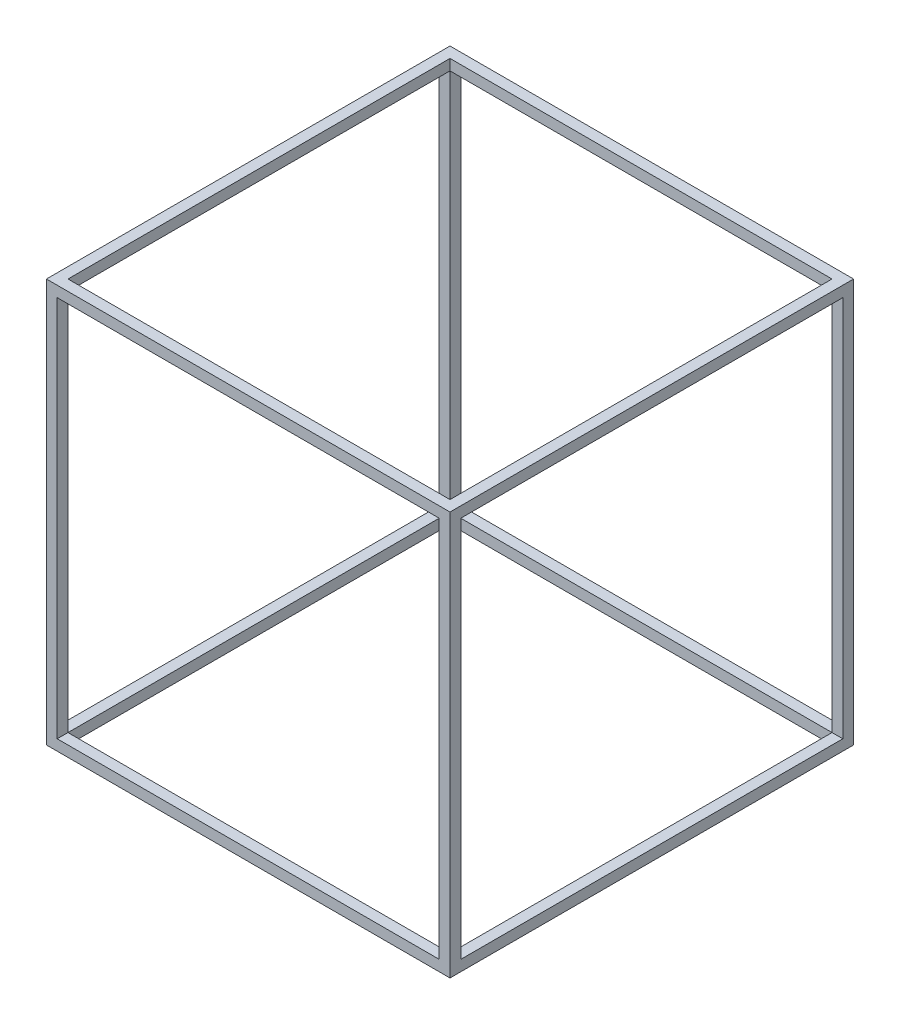
ISO-10303-21;
HEADER;
FILE_DESCRIPTION(('STEP AP214'),'2;1');
FILE_NAME('part.step','',(''),(''),'','','');
FILE_SCHEMA(('AUTOMOTIVE_DESIGN { 1 0 10303 214 1 1 1 1 }'));
ENDSEC;
DATA;
#1=APPLICATION_CONTEXT('core data for automotive mechanical design processes');
#2=APPLICATION_PROTOCOL_DEFINITION('international standard','automotive_design',2000,#1);
#3=PRODUCT_CONTEXT('',#1,'mechanical');
#4=PRODUCT('Part','Part','',(#3));
#5=PRODUCT_RELATED_PRODUCT_CATEGORY('part','',(#4));
#6=PRODUCT_DEFINITION_FORMATION('','',#4);
#7=PRODUCT_DEFINITION_CONTEXT('part definition',#1,'design');
#8=PRODUCT_DEFINITION('design','',#6,#7);
#9=PRODUCT_DEFINITION_SHAPE('','',#8);
#10=(LENGTH_UNIT() NAMED_UNIT(*) SI_UNIT(.MILLI.,.METRE.));
#11=(NAMED_UNIT(*) PLANE_ANGLE_UNIT() SI_UNIT($,.RADIAN.));
#12=(NAMED_UNIT(*) SI_UNIT($,.STERADIAN.) SOLID_ANGLE_UNIT());
#13=UNCERTAINTY_MEASURE_WITH_UNIT(LENGTH_MEASURE(1.E-05),#10,'distance_accuracy_value','');
#14=(GEOMETRIC_REPRESENTATION_CONTEXT(3) GLOBAL_UNCERTAINTY_ASSIGNED_CONTEXT((#13)) GLOBAL_UNIT_ASSIGNED_CONTEXT((#10,
#11,#12)) REPRESENTATION_CONTEXT('',''));
#15=CARTESIAN_POINT('',(0.,0.,0.));
#16=DIRECTION('',(0.,0.,1.));
#17=DIRECTION('',(1.,0.,0.));
#18=AXIS2_PLACEMENT_3D('',#15,#16,#17);
#19=CARTESIAN_POINT('',(0.,20.,0.));
#20=DIRECTION('',(0.,-1.,0.));
#21=DIRECTION('',(0.,0.,-1.));
#22=AXIS2_PLACEMENT_3D('',#19,#20,#21);
#23=PLANE('',#22);
#24=DIRECTION('',(-1.,0.,0.));
#25=VECTOR('',#24,1.);
#26=CARTESIAN_POINT('',(750.,20.,-20.));
#27=LINE('',#26,#25);
#28=CARTESIAN_POINT('',(750.,20.,-20.));
#29=VERTEX_POINT('',#28);
#30=CARTESIAN_POINT('',(730.,20.,-20.));
#31=VERTEX_POINT('',#30);
#32=EDGE_CURVE('E233',#29,#31,#27,.T.);
#33=ORIENTED_EDGE('',*,*,#32,.F.);
#34=DIRECTION('',(0.,0.,-1.));
#35=VECTOR('',#34,1.);
#36=CARTESIAN_POINT('',(750.,20.,0.));
#37=LINE('',#36,#35);
#38=CARTESIAN_POINT('',(750.,20.,-730.));
#39=VERTEX_POINT('',#38);
#40=EDGE_CURVE('E351',#29,#39,#37,.T.);
#41=ORIENTED_EDGE('',*,*,#40,.T.);
#42=DIRECTION('',(1.,0.,0.));
#43=VECTOR('',#42,1.);
#44=CARTESIAN_POINT('',(750.,20.,-730.));
#45=LINE('',#44,#43);
#46=CARTESIAN_POINT('',(730.,20.,-730.));
#47=VERTEX_POINT('',#46);
#48=EDGE_CURVE('E288',#47,#39,#45,.T.);
#49=ORIENTED_EDGE('',*,*,#48,.F.);
#50=DIRECTION('',(0.,0.,-1.));
#51=VECTOR('',#50,1.);
#52=CARTESIAN_POINT('',(730.,20.,-20.));
#53=LINE('',#52,#51);
#54=EDGE_CURVE('E474',#31,#47,#53,.T.);
#55=ORIENTED_EDGE('',*,*,#54,.F.);
#56=EDGE_LOOP('',(#33,#41,#49,#55));
#57=FACE_BOUND('',#56,.T.);
#58=ADVANCED_FACE('F33',(#57),#23,.F.);
#59=DIRECTION('',(0.,0.,1.));
#60=VECTOR('',#59,1.);
#61=CARTESIAN_POINT('',(730.,20.,0.));
#62=LINE('',#61,#60);
#63=CARTESIAN_POINT('',(730.,20.,0.));
#64=VERTEX_POINT('',#63);
#65=EDGE_CURVE('E248',#31,#64,#62,.T.);
#66=ORIENTED_EDGE('',*,*,#65,.F.);
#67=DIRECTION('',(1.,0.,0.));
#68=VECTOR('',#67,1.);
#69=CARTESIAN_POINT('',(20.,20.,-20.));
#70=LINE('',#69,#68);
#71=CARTESIAN_POINT('',(20.,20.,-20.));
#72=VERTEX_POINT('',#71);
#73=EDGE_CURVE('E444',#72,#31,#70,.T.);
#74=ORIENTED_EDGE('',*,*,#73,.F.);
#75=DIRECTION('',(0.,0.,-1.));
#76=VECTOR('',#75,1.);
#77=CARTESIAN_POINT('',(20.,20.,0.));
#78=LINE('',#77,#76);
#79=CARTESIAN_POINT('',(20.,20.,0.));
#80=VERTEX_POINT('',#79);
#81=EDGE_CURVE('E263',#80,#72,#78,.T.);
#82=ORIENTED_EDGE('',*,*,#81,.F.);
#83=DIRECTION('',(1.,0.,0.));
#84=VECTOR('',#83,1.);
#85=CARTESIAN_POINT('',(0.,20.,0.));
#86=LINE('',#85,#84);
#87=EDGE_CURVE('E51',#80,#64,#86,.T.);
#88=ORIENTED_EDGE('',*,*,#87,.T.);
#89=EDGE_LOOP('',(#66,#74,#82,#88));
#90=FACE_BOUND('',#89,.T.);
#91=ADVANCED_FACE('F397',(#90),#23,.F.);
#92=DIRECTION('',(-1.,0.,0.));
#93=VECTOR('',#92,1.);
#94=CARTESIAN_POINT('',(0.,20.,-20.));
#95=LINE('',#94,#93);
#96=CARTESIAN_POINT('',(0.,20.,-20.));
#97=VERTEX_POINT('',#96);
#98=EDGE_CURVE('E268',#72,#97,#95,.T.);
#99=ORIENTED_EDGE('',*,*,#98,.F.);
#100=DIRECTION('',(0.,0.,1.));
#101=VECTOR('',#100,1.);
#102=CARTESIAN_POINT('',(20.,20.,-20.));
#103=LINE('',#102,#101);
#104=CARTESIAN_POINT('',(20.,20.,-730.));
#105=VERTEX_POINT('',#104);
#106=EDGE_CURVE('E448',#105,#72,#103,.T.);
#107=ORIENTED_EDGE('',*,*,#106,.F.);
#108=DIRECTION('',(1.,0.,0.));
#109=VECTOR('',#108,1.);
#110=CARTESIAN_POINT('',(0.,20.,-730.));
#111=LINE('',#110,#109);
#112=CARTESIAN_POINT('',(0.,20.,-730.));
#113=VERTEX_POINT('',#112);
#114=EDGE_CURVE('E304',#113,#105,#111,.T.);
#115=ORIENTED_EDGE('',*,*,#114,.F.);
#116=DIRECTION('',(0.,0.,1.));
#117=VECTOR('',#116,1.);
#118=CARTESIAN_POINT('',(0.,20.,0.));
#119=LINE('',#118,#117);
#120=EDGE_CURVE('E59',#113,#97,#119,.T.);
#121=ORIENTED_EDGE('',*,*,#120,.T.);
#122=EDGE_LOOP('',(#99,#107,#115,#121));
#123=FACE_BOUND('',#122,.T.);
#124=ADVANCED_FACE('F404',(#123),#23,.F.);
#125=DIRECTION('',(0.,0.,1.));
#126=VECTOR('',#125,1.);
#127=CARTESIAN_POINT('',(730.,20.,-750.));
#128=LINE('',#127,#126);
#129=CARTESIAN_POINT('',(730.,20.,-750.));
#130=VERTEX_POINT('',#129);
#131=EDGE_CURVE('E283',#130,#47,#128,.T.);
#132=ORIENTED_EDGE('',*,*,#131,.F.);
#133=DIRECTION('',(-1.,0.,0.));
#134=VECTOR('',#133,1.);
#135=CARTESIAN_POINT('',(0.,20.,-750.));
#136=LINE('',#135,#134);
#137=CARTESIAN_POINT('',(20.,20.,-750.));
#138=VERTEX_POINT('',#137);
#139=EDGE_CURVE('E37',#130,#138,#136,.T.);
#140=ORIENTED_EDGE('',*,*,#139,.T.);
#141=DIRECTION('',(0.,0.,-1.));
#142=VECTOR('',#141,1.);
#143=CARTESIAN_POINT('',(20.,20.,-750.));
#144=LINE('',#143,#142);
#145=EDGE_CURVE('E309',#105,#138,#144,.T.);
#146=ORIENTED_EDGE('',*,*,#145,.F.);
#147=DIRECTION('',(-1.,0.,0.));
#148=VECTOR('',#147,1.);
#149=CARTESIAN_POINT('',(20.,20.,-730.));
#150=LINE('',#149,#148);
#151=EDGE_CURVE('E418',#47,#105,#150,.T.);
#152=ORIENTED_EDGE('',*,*,#151,.F.);
#153=EDGE_LOOP('',(#132,#140,#146,#152));
#154=FACE_BOUND('',#153,.T.);
#155=ADVANCED_FACE('F400',(#154),#23,.F.);
#156=CARTESIAN_POINT('',(0.,0.,0.));
#157=DIRECTION('',(0.,-1.,0.));
#158=DIRECTION('',(0.,0.,-1.));
#159=AXIS2_PLACEMENT_3D('',#156,#157,#158);
#160=PLANE('',#159);
#161=DIRECTION('',(0.,0.,1.));
#162=VECTOR('',#161,1.);
#163=CARTESIAN_POINT('',(0.,0.,0.));
#164=LINE('',#163,#162);
#165=CARTESIAN_POINT('',(0.,0.,-750.));
#166=VERTEX_POINT('',#165);
#167=CARTESIAN_POINT('',(0.,0.,0.));
#168=VERTEX_POINT('',#167);
#169=EDGE_CURVE('E354',#166,#168,#164,.T.);
#170=ORIENTED_EDGE('',*,*,#169,.F.);
#171=DIRECTION('',(-1.,0.,0.));
#172=VECTOR('',#171,1.);
#173=CARTESIAN_POINT('',(0.,0.,-750.));
#174=LINE('',#173,#172);
#175=CARTESIAN_POINT('',(750.,0.,-750.));
#176=VERTEX_POINT('',#175);
#177=EDGE_CURVE('E343',#176,#166,#174,.T.);
#178=ORIENTED_EDGE('',*,*,#177,.F.);
#179=DIRECTION('',(0.,0.,-1.));
#180=VECTOR('',#179,1.);
#181=CARTESIAN_POINT('',(750.,0.,0.));
#182=LINE('',#181,#180);
#183=CARTESIAN_POINT('',(750.,0.,0.));
#184=VERTEX_POINT('',#183);
#185=EDGE_CURVE('E359',#184,#176,#182,.T.);
#186=ORIENTED_EDGE('',*,*,#185,.F.);
#187=DIRECTION('',(1.,0.,0.));
#188=VECTOR('',#187,1.);
#189=CARTESIAN_POINT('',(0.,0.,0.));
#190=LINE('',#189,#188);
#191=EDGE_CURVE('E357',#168,#184,#190,.T.);
#192=ORIENTED_EDGE('',*,*,#191,.F.);
#193=EDGE_LOOP('',(#170,#178,#186,#192));
#194=FACE_BOUND('',#193,.T.);
#195=DIRECTION('',(-1.,0.,0.));
#196=VECTOR('',#195,1.);
#197=CARTESIAN_POINT('',(20.,0.,-730.));
#198=LINE('',#197,#196);
#199=CARTESIAN_POINT('',(730.,0.,-730.));
#200=VERTEX_POINT('',#199);
#201=CARTESIAN_POINT('',(20.,0.,-730.));
#202=VERTEX_POINT('',#201);
#203=EDGE_CURVE('E456',#200,#202,#198,.T.);
#204=ORIENTED_EDGE('',*,*,#203,.T.);
#205=DIRECTION('',(0.,0.,1.));
#206=VECTOR('',#205,1.);
#207=CARTESIAN_POINT('',(20.,0.,-20.));
#208=LINE('',#207,#206);
#209=CARTESIAN_POINT('',(20.,0.,-20.));
#210=VERTEX_POINT('',#209);
#211=EDGE_CURVE('E331',#202,#210,#208,.T.);
#212=ORIENTED_EDGE('',*,*,#211,.T.);
#213=DIRECTION('',(1.,0.,0.));
#214=VECTOR('',#213,1.);
#215=CARTESIAN_POINT('',(20.,0.,-20.));
#216=LINE('',#215,#214);
#217=CARTESIAN_POINT('',(730.,0.,-20.));
#218=VERTEX_POINT('',#217);
#219=EDGE_CURVE('E336',#210,#218,#216,.T.);
#220=ORIENTED_EDGE('',*,*,#219,.T.);
#221=DIRECTION('',(0.,0.,-1.));
#222=VECTOR('',#221,1.);
#223=CARTESIAN_POINT('',(730.,0.,-20.));
#224=LINE('',#223,#222);
#225=EDGE_CURVE('E469',#218,#200,#224,.T.);
#226=ORIENTED_EDGE('',*,*,#225,.T.);
#227=EDGE_LOOP('',(#204,#212,#220,#226));
#228=FACE_BOUND('',#227,.T.);
#229=ADVANCED_FACE('F378',(#194,#228),#160,.T.);
#230=CARTESIAN_POINT('',(0.,20.,0.));
#231=DIRECTION('',(1.,0.,0.));
#232=DIRECTION('',(0.,0.,-1.));
#233=AXIS2_PLACEMENT_3D('',#230,#231,#232);
#234=PLANE('',#233);
#235=DIRECTION('',(0.,-1.,0.));
#236=VECTOR('',#235,1.);
#237=CARTESIAN_POINT('',(0.,730.,-730.));
#238=LINE('',#237,#236);
#239=CARTESIAN_POINT('',(0.,730.,-730.));
#240=VERTEX_POINT('',#239);
#241=EDGE_CURVE('E327',#240,#113,#238,.T.);
#242=ORIENTED_EDGE('',*,*,#241,.F.);
#243=DIRECTION('',(0.,0.,1.));
#244=VECTOR('',#243,1.);
#245=CARTESIAN_POINT('',(0.,730.,-20.));
#246=LINE('',#245,#244);
#247=CARTESIAN_POINT('',(0.,730.,-20.));
#248=VERTEX_POINT('',#247);
#249=EDGE_CURVE('E236',#240,#248,#246,.T.);
#250=ORIENTED_EDGE('',*,*,#249,.T.);
#251=DIRECTION('',(0.,-1.,0.));
#252=VECTOR('',#251,1.);
#253=CARTESIAN_POINT('',(0.,730.,-20.));
#254=LINE('',#253,#252);
#255=EDGE_CURVE('E271',#248,#97,#254,.T.);
#256=ORIENTED_EDGE('',*,*,#255,.T.);
#257=ORIENTED_EDGE('',*,*,#120,.F.);
#258=EDGE_LOOP('',(#242,#250,#256,#257));
#259=FACE_BOUND('',#258,.T.);
#260=ORIENTED_EDGE('',*,*,#169,.T.);
#261=DIRECTION('',(0.,-1.,0.));
#262=VECTOR('',#261,1.);
#263=CARTESIAN_POINT('',(0.,20.,0.));
#264=LINE('',#263,#262);
#265=CARTESIAN_POINT('',(0.,750.,0.));
#266=VERTEX_POINT('',#265);
#267=EDGE_CURVE('E11',#266,#168,#264,.T.);
#268=ORIENTED_EDGE('',*,*,#267,.F.);
#269=DIRECTION('',(0.,0.,1.));
#270=VECTOR('',#269,1.);
#271=CARTESIAN_POINT('',(0.,750.,-750.));
#272=LINE('',#271,#270);
#273=CARTESIAN_POINT('',(0.,750.,-750.));
#274=VERTEX_POINT('',#273);
#275=EDGE_CURVE('E223',#274,#266,#272,.T.);
#276=ORIENTED_EDGE('',*,*,#275,.F.);
#277=DIRECTION('',(0.,-1.,0.));
#278=VECTOR('',#277,1.);
#279=CARTESIAN_POINT('',(0.,20.,-750.));
#280=LINE('',#279,#278);
#281=EDGE_CURVE('E362',#274,#166,#280,.T.);
#282=ORIENTED_EDGE('',*,*,#281,.T.);
#283=EDGE_LOOP('',(#260,#268,#276,#282));
#284=FACE_BOUND('',#283,.T.);
#285=ADVANCED_FACE('F35',(#259,#284),#234,.F.);
#286=CARTESIAN_POINT('',(0.,20.,0.));
#287=DIRECTION('',(0.,0.,-1.));
#288=DIRECTION('',(-1.,0.,0.));
#289=AXIS2_PLACEMENT_3D('',#286,#287,#288);
#290=PLANE('',#289);
#291=DIRECTION('',(0.,-1.,0.));
#292=VECTOR('',#291,1.);
#293=CARTESIAN_POINT('',(20.,730.,0.));
#294=LINE('',#293,#292);
#295=CARTESIAN_POINT('',(20.,730.,0.));
#296=VERTEX_POINT('',#295);
#297=EDGE_CURVE('E280',#296,#80,#294,.T.);
#298=ORIENTED_EDGE('',*,*,#297,.F.);
#299=DIRECTION('',(1.,0.,0.));
#300=VECTOR('',#299,1.);
#301=CARTESIAN_POINT('',(730.,730.,0.));
#302=LINE('',#301,#300);
#303=CARTESIAN_POINT('',(730.,730.,0.));
#304=VERTEX_POINT('',#303);
#305=EDGE_CURVE('E239',#296,#304,#302,.T.);
#306=ORIENTED_EDGE('',*,*,#305,.T.);
#307=DIRECTION('',(0.,-1.,0.));
#308=VECTOR('',#307,1.);
#309=CARTESIAN_POINT('',(730.,730.,0.));
#310=LINE('',#309,#308);
#311=EDGE_CURVE('E251',#304,#64,#310,.T.);
#312=ORIENTED_EDGE('',*,*,#311,.T.);
#313=ORIENTED_EDGE('',*,*,#87,.F.);
#314=EDGE_LOOP('',(#298,#306,#312,#313));
#315=FACE_BOUND('',#314,.T.);
#316=ORIENTED_EDGE('',*,*,#191,.T.);
#317=DIRECTION('',(0.,-1.,0.));
#318=VECTOR('',#317,1.);
#319=CARTESIAN_POINT('',(750.,20.,0.));
#320=LINE('',#319,#318);
#321=CARTESIAN_POINT('',(750.,750.,0.));
#322=VERTEX_POINT('',#321);
#323=EDGE_CURVE('E43',#322,#184,#320,.T.);
#324=ORIENTED_EDGE('',*,*,#323,.F.);
#325=DIRECTION('',(1.,0.,0.));
#326=VECTOR('',#325,1.);
#327=CARTESIAN_POINT('',(0.,750.,0.));
#328=LINE('',#327,#326);
#329=EDGE_CURVE('E227',#266,#322,#328,.T.);
#330=ORIENTED_EDGE('',*,*,#329,.F.);
#331=ORIENTED_EDGE('',*,*,#267,.T.);
#332=EDGE_LOOP('',(#316,#324,#330,#331));
#333=FACE_BOUND('',#332,.T.);
#334=ADVANCED_FACE('F386',(#315,#333),#290,.F.);
#335=CARTESIAN_POINT('',(750.,20.,0.));
#336=DIRECTION('',(-1.,0.,0.));
#337=DIRECTION('',(0.,0.,1.));
#338=AXIS2_PLACEMENT_3D('',#335,#336,#337);
#339=PLANE('',#338);
#340=DIRECTION('',(0.,-1.,0.));
#341=VECTOR('',#340,1.);
#342=CARTESIAN_POINT('',(750.,20.,-750.));
#343=LINE('',#342,#341);
#344=CARTESIAN_POINT('',(750.,750.,-750.));
#345=VERTEX_POINT('',#344);
#346=EDGE_CURVE('E365',#345,#176,#343,.T.);
#347=ORIENTED_EDGE('',*,*,#346,.F.);
#348=DIRECTION('',(0.,0.,-1.));
#349=VECTOR('',#348,1.);
#350=CARTESIAN_POINT('',(750.,750.,0.));
#351=LINE('',#350,#349);
#352=EDGE_CURVE('E230',#322,#345,#351,.T.);
#353=ORIENTED_EDGE('',*,*,#352,.F.);
#354=ORIENTED_EDGE('',*,*,#323,.T.);
#355=ORIENTED_EDGE('',*,*,#185,.T.);
#356=EDGE_LOOP('',(#347,#353,#354,#355));
#357=FACE_BOUND('',#356,.T.);
#358=DIRECTION('',(0.,0.,-1.));
#359=VECTOR('',#358,1.);
#360=CARTESIAN_POINT('',(750.,730.,-730.));
#361=LINE('',#360,#359);
#362=CARTESIAN_POINT('',(750.,730.,-20.));
#363=VERTEX_POINT('',#362);
#364=CARTESIAN_POINT('',(750.,730.,-730.));
#365=VERTEX_POINT('',#364);
#366=EDGE_CURVE('E224',#363,#365,#361,.T.);
#367=ORIENTED_EDGE('',*,*,#366,.T.);
#368=DIRECTION('',(0.,-1.,0.));
#369=VECTOR('',#368,1.);
#370=CARTESIAN_POINT('',(750.,730.,-730.));
#371=LINE('',#370,#369);
#372=EDGE_CURVE('E291',#365,#39,#371,.T.);
#373=ORIENTED_EDGE('',*,*,#372,.T.);
#374=ORIENTED_EDGE('',*,*,#40,.F.);
#375=DIRECTION('',(0.,-1.,0.));
#376=VECTOR('',#375,1.);
#377=CARTESIAN_POINT('',(750.,730.,-20.));
#378=LINE('',#377,#376);
#379=EDGE_CURVE('E260',#363,#29,#378,.T.);
#380=ORIENTED_EDGE('',*,*,#379,.F.);
#381=EDGE_LOOP('',(#367,#373,#374,#380));
#382=FACE_BOUND('',#381,.T.);
#383=ADVANCED_FACE('F371',(#357,#382),#339,.F.);
#384=CARTESIAN_POINT('',(0.,20.,-750.));
#385=DIRECTION('',(0.,0.,1.));
#386=DIRECTION('',(1.,0.,0.));
#387=AXIS2_PLACEMENT_3D('',#384,#385,#386);
#388=PLANE('',#387);
#389=ORIENTED_EDGE('',*,*,#281,.F.);
#390=DIRECTION('',(-1.,0.,0.));
#391=VECTOR('',#390,1.);
#392=CARTESIAN_POINT('',(750.,750.,-750.));
#393=LINE('',#392,#391);
#394=EDGE_CURVE('E220',#345,#274,#393,.T.);
#395=ORIENTED_EDGE('',*,*,#394,.F.);
#396=ORIENTED_EDGE('',*,*,#346,.T.);
#397=ORIENTED_EDGE('',*,*,#177,.T.);
#398=EDGE_LOOP('',(#389,#395,#396,#397));
#399=FACE_BOUND('',#398,.T.);
#400=DIRECTION('',(-1.,0.,0.));
#401=VECTOR('',#400,1.);
#402=CARTESIAN_POINT('',(20.,730.,-750.));
#403=LINE('',#402,#401);
#404=CARTESIAN_POINT('',(730.,730.,-750.));
#405=VERTEX_POINT('',#404);
#406=CARTESIAN_POINT('',(20.,730.,-750.));
#407=VERTEX_POINT('',#406);
#408=EDGE_CURVE('E195',#405,#407,#403,.T.);
#409=ORIENTED_EDGE('',*,*,#408,.T.);
#410=DIRECTION('',(0.,-1.,0.));
#411=VECTOR('',#410,1.);
#412=CARTESIAN_POINT('',(20.,730.,-750.));
#413=LINE('',#412,#411);
#414=EDGE_CURVE('E312',#407,#138,#413,.T.);
#415=ORIENTED_EDGE('',*,*,#414,.T.);
#416=ORIENTED_EDGE('',*,*,#139,.F.);
#417=DIRECTION('',(0.,-1.,0.));
#418=VECTOR('',#417,1.);
#419=CARTESIAN_POINT('',(730.,730.,-750.));
#420=LINE('',#419,#418);
#421=EDGE_CURVE('E301',#405,#130,#420,.T.);
#422=ORIENTED_EDGE('',*,*,#421,.F.);
#423=EDGE_LOOP('',(#409,#415,#416,#422));
#424=FACE_BOUND('',#423,.T.);
#425=ADVANCED_FACE('F381',(#399,#424),#388,.F.);
#426=CARTESIAN_POINT('',(20.,20.,-20.));
#427=DIRECTION('',(1.,0.,0.));
#428=DIRECTION('',(0.,0.,-1.));
#429=AXIS2_PLACEMENT_3D('',#426,#427,#428);
#430=PLANE('',#429);
#431=ORIENTED_EDGE('',*,*,#211,.F.);
#432=DIRECTION('',(0.,-1.,0.));
#433=VECTOR('',#432,1.);
#434=CARTESIAN_POINT('',(20.,20.,-730.));
#435=LINE('',#434,#433);
#436=EDGE_CURVE('E455',#105,#202,#435,.T.);
#437=ORIENTED_EDGE('',*,*,#436,.F.);
#438=ORIENTED_EDGE('',*,*,#106,.T.);
#439=DIRECTION('',(0.,-1.,0.));
#440=VECTOR('',#439,1.);
#441=CARTESIAN_POINT('',(20.,20.,-20.));
#442=LINE('',#441,#440);
#443=EDGE_CURVE('E348',#72,#210,#442,.T.);
#444=ORIENTED_EDGE('',*,*,#443,.T.);
#445=EDGE_LOOP('',(#431,#437,#438,#444));
#446=FACE_BOUND('',#445,.T.);
#447=ADVANCED_FACE('F453',(#446),#430,.T.);
#448=CARTESIAN_POINT('',(20.,20.,-20.));
#449=DIRECTION('',(0.,0.,-1.));
#450=DIRECTION('',(-1.,0.,0.));
#451=AXIS2_PLACEMENT_3D('',#448,#449,#450);
#452=PLANE('',#451);
#453=ORIENTED_EDGE('',*,*,#219,.F.);
#454=ORIENTED_EDGE('',*,*,#443,.F.);
#455=ORIENTED_EDGE('',*,*,#73,.T.);
#456=DIRECTION('',(0.,-1.,0.));
#457=VECTOR('',#456,1.);
#458=CARTESIAN_POINT('',(730.,20.,-20.));
#459=LINE('',#458,#457);
#460=EDGE_CURVE('E461',#31,#218,#459,.T.);
#461=ORIENTED_EDGE('',*,*,#460,.T.);
#462=EDGE_LOOP('',(#453,#454,#455,#461));
#463=FACE_BOUND('',#462,.T.);
#464=ADVANCED_FACE('F458',(#463),#452,.T.);
#465=CARTESIAN_POINT('',(730.,20.,-20.));
#466=DIRECTION('',(-1.,0.,0.));
#467=DIRECTION('',(0.,0.,1.));
#468=AXIS2_PLACEMENT_3D('',#465,#466,#467);
#469=PLANE('',#468);
#470=ORIENTED_EDGE('',*,*,#225,.F.);
#471=ORIENTED_EDGE('',*,*,#460,.F.);
#472=ORIENTED_EDGE('',*,*,#54,.T.);
#473=DIRECTION('',(0.,-1.,0.));
#474=VECTOR('',#473,1.);
#475=CARTESIAN_POINT('',(730.,20.,-730.));
#476=LINE('',#475,#474);
#477=EDGE_CURVE('E462',#47,#200,#476,.T.);
#478=ORIENTED_EDGE('',*,*,#477,.T.);
#479=EDGE_LOOP('',(#470,#471,#472,#478));
#480=FACE_BOUND('',#479,.T.);
#481=ADVANCED_FACE('F479',(#480),#469,.T.);
#482=CARTESIAN_POINT('',(20.,20.,-730.));
#483=DIRECTION('',(0.,0.,1.));
#484=DIRECTION('',(1.,0.,0.));
#485=AXIS2_PLACEMENT_3D('',#482,#483,#484);
#486=PLANE('',#485);
#487=ORIENTED_EDGE('',*,*,#203,.F.);
#488=ORIENTED_EDGE('',*,*,#477,.F.);
#489=ORIENTED_EDGE('',*,*,#151,.T.);
#490=ORIENTED_EDGE('',*,*,#436,.T.);
#491=EDGE_LOOP('',(#487,#488,#489,#490));
#492=FACE_BOUND('',#491,.T.);
#493=ADVANCED_FACE('F508',(#492),#486,.T.);
#494=CARTESIAN_POINT('',(0.,730.,-730.));
#495=DIRECTION('',(0.,0.,-1.));
#496=DIRECTION('',(-1.,0.,0.));
#497=AXIS2_PLACEMENT_3D('',#494,#495,#496);
#498=PLANE('',#497);
#499=ORIENTED_EDGE('',*,*,#114,.T.);
#500=DIRECTION('',(0.,-1.,0.));
#501=VECTOR('',#500,1.);
#502=CARTESIAN_POINT('',(20.,730.,-730.));
#503=LINE('',#502,#501);
#504=CARTESIAN_POINT('',(20.,730.,-730.));
#505=VERTEX_POINT('',#504);
#506=EDGE_CURVE('E315',#505,#105,#503,.T.);
#507=ORIENTED_EDGE('',*,*,#506,.F.);
#508=DIRECTION('',(1.,0.,0.));
#509=VECTOR('',#508,1.);
#510=CARTESIAN_POINT('',(0.,730.,-730.));
#511=LINE('',#510,#509);
#512=EDGE_CURVE('E305',#240,#505,#511,.T.);
#513=ORIENTED_EDGE('',*,*,#512,.F.);
#514=ORIENTED_EDGE('',*,*,#241,.T.);
#515=EDGE_LOOP('',(#499,#507,#513,#514));
#516=FACE_BOUND('',#515,.T.);
#517=ADVANCED_FACE('F505',(#516),#498,.F.);
#518=CARTESIAN_POINT('',(20.,730.,-750.));
#519=DIRECTION('',(-1.,0.,0.));
#520=DIRECTION('',(0.,0.,1.));
#521=AXIS2_PLACEMENT_3D('',#518,#519,#520);
#522=PLANE('',#521);
#523=ORIENTED_EDGE('',*,*,#145,.T.);
#524=ORIENTED_EDGE('',*,*,#414,.F.);
#525=DIRECTION('',(0.,0.,-1.));
#526=VECTOR('',#525,1.);
#527=CARTESIAN_POINT('',(20.,730.,-750.));
#528=LINE('',#527,#526);
#529=EDGE_CURVE('E308',#505,#407,#528,.T.);
#530=ORIENTED_EDGE('',*,*,#529,.F.);
#531=ORIENTED_EDGE('',*,*,#506,.T.);
#532=EDGE_LOOP('',(#523,#524,#530,#531));
#533=FACE_BOUND('',#532,.T.);
#534=ADVANCED_FACE('F425',(#533),#522,.F.);
#535=CARTESIAN_POINT('',(730.,730.,-750.));
#536=DIRECTION('',(1.,0.,0.));
#537=DIRECTION('',(0.,0.,-1.));
#538=AXIS2_PLACEMENT_3D('',#535,#536,#537);
#539=PLANE('',#538);
#540=ORIENTED_EDGE('',*,*,#131,.T.);
#541=DIRECTION('',(0.,-1.,0.));
#542=VECTOR('',#541,1.);
#543=CARTESIAN_POINT('',(730.,730.,-730.));
#544=LINE('',#543,#542);
#545=CARTESIAN_POINT('',(730.,730.,-730.));
#546=VERTEX_POINT('',#545);
#547=EDGE_CURVE('E298',#546,#47,#544,.T.);
#548=ORIENTED_EDGE('',*,*,#547,.F.);
#549=DIRECTION('',(0.,0.,1.));
#550=VECTOR('',#549,1.);
#551=CARTESIAN_POINT('',(730.,730.,-750.));
#552=LINE('',#551,#550);
#553=EDGE_CURVE('E284',#405,#546,#552,.T.);
#554=ORIENTED_EDGE('',*,*,#553,.F.);
#555=ORIENTED_EDGE('',*,*,#421,.T.);
#556=EDGE_LOOP('',(#540,#548,#554,#555));
#557=FACE_BOUND('',#556,.T.);
#558=ADVANCED_FACE('F421',(#557),#539,.F.);
#559=CARTESIAN_POINT('',(750.,730.,-730.));
#560=DIRECTION('',(0.,0.,-1.));
#561=DIRECTION('',(-1.,0.,0.));
#562=AXIS2_PLACEMENT_3D('',#559,#560,#561);
#563=PLANE('',#562);
#564=ORIENTED_EDGE('',*,*,#48,.T.);
#565=ORIENTED_EDGE('',*,*,#372,.F.);
#566=DIRECTION('',(1.,0.,0.));
#567=VECTOR('',#566,1.);
#568=CARTESIAN_POINT('',(750.,730.,-730.));
#569=LINE('',#568,#567);
#570=EDGE_CURVE('E287',#546,#365,#569,.T.);
#571=ORIENTED_EDGE('',*,*,#570,.F.);
#572=ORIENTED_EDGE('',*,*,#547,.T.);
#573=EDGE_LOOP('',(#564,#565,#571,#572));
#574=FACE_BOUND('',#573,.T.);
#575=ADVANCED_FACE('F492',(#574),#563,.F.);
#576=CARTESIAN_POINT('',(20.,730.,0.));
#577=DIRECTION('',(-1.,0.,0.));
#578=DIRECTION('',(0.,0.,1.));
#579=AXIS2_PLACEMENT_3D('',#576,#577,#578);
#580=PLANE('',#579);
#581=ORIENTED_EDGE('',*,*,#81,.T.);
#582=DIRECTION('',(0.,-1.,0.));
#583=VECTOR('',#582,1.);
#584=CARTESIAN_POINT('',(20.,730.,-20.));
#585=LINE('',#584,#583);
#586=CARTESIAN_POINT('',(20.,730.,-20.));
#587=VERTEX_POINT('',#586);
#588=EDGE_CURVE('E277',#587,#72,#585,.T.);
#589=ORIENTED_EDGE('',*,*,#588,.F.);
#590=DIRECTION('',(0.,0.,-1.));
#591=VECTOR('',#590,1.);
#592=CARTESIAN_POINT('',(20.,730.,0.));
#593=LINE('',#592,#591);
#594=EDGE_CURVE('E264',#296,#587,#593,.T.);
#595=ORIENTED_EDGE('',*,*,#594,.F.);
#596=ORIENTED_EDGE('',*,*,#297,.T.);
#597=EDGE_LOOP('',(#581,#589,#595,#596));
#598=FACE_BOUND('',#597,.T.);
#599=ADVANCED_FACE('F440',(#598),#580,.F.);
#600=CARTESIAN_POINT('',(0.,730.,-20.));
#601=DIRECTION('',(0.,0.,1.));
#602=DIRECTION('',(1.,0.,0.));
#603=AXIS2_PLACEMENT_3D('',#600,#601,#602);
#604=PLANE('',#603);
#605=ORIENTED_EDGE('',*,*,#98,.T.);
#606=ORIENTED_EDGE('',*,*,#255,.F.);
#607=DIRECTION('',(-1.,0.,0.));
#608=VECTOR('',#607,1.);
#609=CARTESIAN_POINT('',(0.,730.,-20.));
#610=LINE('',#609,#608);
#611=EDGE_CURVE('E267',#587,#248,#610,.T.);
#612=ORIENTED_EDGE('',*,*,#611,.F.);
#613=ORIENTED_EDGE('',*,*,#588,.T.);
#614=EDGE_LOOP('',(#605,#606,#612,#613));
#615=FACE_BOUND('',#614,.T.);
#616=ADVANCED_FACE('F446',(#615),#604,.F.);
#617=CARTESIAN_POINT('',(750.,730.,-20.));
#618=DIRECTION('',(0.,0.,1.));
#619=DIRECTION('',(1.,0.,0.));
#620=AXIS2_PLACEMENT_3D('',#617,#618,#619);
#621=PLANE('',#620);
#622=ORIENTED_EDGE('',*,*,#32,.T.);
#623=DIRECTION('',(0.,-1.,0.));
#624=VECTOR('',#623,1.);
#625=CARTESIAN_POINT('',(730.,730.,-20.));
#626=LINE('',#625,#624);
#627=CARTESIAN_POINT('',(730.,730.,-20.));
#628=VERTEX_POINT('',#627);
#629=EDGE_CURVE('E257',#628,#31,#626,.T.);
#630=ORIENTED_EDGE('',*,*,#629,.F.);
#631=DIRECTION('',(-1.,0.,0.));
#632=VECTOR('',#631,1.);
#633=CARTESIAN_POINT('',(750.,730.,-20.));
#634=LINE('',#633,#632);
#635=EDGE_CURVE('E244',#363,#628,#634,.T.);
#636=ORIENTED_EDGE('',*,*,#635,.F.);
#637=ORIENTED_EDGE('',*,*,#379,.T.);
#638=EDGE_LOOP('',(#622,#630,#636,#637));
#639=FACE_BOUND('',#638,.T.);
#640=ADVANCED_FACE('F483',(#639),#621,.F.);
#641=CARTESIAN_POINT('',(730.,730.,0.));
#642=DIRECTION('',(1.,0.,0.));
#643=DIRECTION('',(0.,0.,-1.));
#644=AXIS2_PLACEMENT_3D('',#641,#642,#643);
#645=PLANE('',#644);
#646=ORIENTED_EDGE('',*,*,#65,.T.);
#647=ORIENTED_EDGE('',*,*,#311,.F.);
#648=DIRECTION('',(0.,0.,1.));
#649=VECTOR('',#648,1.);
#650=CARTESIAN_POINT('',(730.,730.,0.));
#651=LINE('',#650,#649);
#652=EDGE_CURVE('E247',#628,#304,#651,.T.);
#653=ORIENTED_EDGE('',*,*,#652,.F.);
#654=ORIENTED_EDGE('',*,*,#629,.T.);
#655=EDGE_LOOP('',(#646,#647,#653,#654));
#656=FACE_BOUND('',#655,.T.);
#657=ADVANCED_FACE('F486',(#656),#645,.F.);
#658=CARTESIAN_POINT('',(0.,730.,0.));
#659=DIRECTION('',(0.,1.,0.));
#660=DIRECTION('',(0.,0.,1.));
#661=AXIS2_PLACEMENT_3D('',#658,#659,#660);
#662=PLANE('',#661);
#663=ORIENTED_EDGE('',*,*,#249,.F.);
#664=ORIENTED_EDGE('',*,*,#512,.T.);
#665=DIRECTION('',(0.,0.,1.));
#666=VECTOR('',#665,1.);
#667=CARTESIAN_POINT('',(20.,730.,-730.));
#668=LINE('',#667,#666);
#669=EDGE_CURVE('E210',#505,#587,#668,.T.);
#670=ORIENTED_EDGE('',*,*,#669,.T.);
#671=ORIENTED_EDGE('',*,*,#611,.T.);
#672=EDGE_LOOP('',(#663,#664,#670,#671));
#673=FACE_BOUND('',#672,.T.);
#674=ADVANCED_FACE('F428',(#673),#662,.F.);
#675=DIRECTION('',(-1.,0.,0.));
#676=VECTOR('',#675,1.);
#677=CARTESIAN_POINT('',(730.,730.,-730.));
#678=LINE('',#677,#676);
#679=EDGE_CURVE('E194',#546,#505,#678,.T.);
#680=ORIENTED_EDGE('',*,*,#679,.T.);
#681=ORIENTED_EDGE('',*,*,#529,.T.);
#682=ORIENTED_EDGE('',*,*,#408,.F.);
#683=ORIENTED_EDGE('',*,*,#553,.T.);
#684=EDGE_LOOP('',(#680,#681,#682,#683));
#685=FACE_BOUND('',#684,.T.);
#686=ADVANCED_FACE('F424',(#685),#662,.F.);
#687=DIRECTION('',(0.,0.,-1.));
#688=VECTOR('',#687,1.);
#689=CARTESIAN_POINT('',(730.,730.,-20.));
#690=LINE('',#689,#688);
#691=EDGE_CURVE('E207',#628,#546,#690,.T.);
#692=ORIENTED_EDGE('',*,*,#691,.T.);
#693=ORIENTED_EDGE('',*,*,#570,.T.);
#694=ORIENTED_EDGE('',*,*,#366,.F.);
#695=ORIENTED_EDGE('',*,*,#635,.T.);
#696=EDGE_LOOP('',(#692,#693,#694,#695));
#697=FACE_BOUND('',#696,.T.);
#698=ADVANCED_FACE('F489',(#697),#662,.F.);
#699=ORIENTED_EDGE('',*,*,#305,.F.);
#700=ORIENTED_EDGE('',*,*,#594,.T.);
#701=DIRECTION('',(1.,0.,0.));
#702=VECTOR('',#701,1.);
#703=CARTESIAN_POINT('',(20.,730.,-20.));
#704=LINE('',#703,#702);
#705=EDGE_CURVE('E186',#587,#628,#704,.T.);
#706=ORIENTED_EDGE('',*,*,#705,.T.);
#707=ORIENTED_EDGE('',*,*,#652,.T.);
#708=EDGE_LOOP('',(#699,#700,#706,#707));
#709=FACE_BOUND('',#708,.T.);
#710=ADVANCED_FACE('F437',(#709),#662,.F.);
#711=CARTESIAN_POINT('',(0.,750.,0.));
#712=DIRECTION('',(0.,1.,0.));
#713=DIRECTION('',(0.,0.,1.));
#714=AXIS2_PLACEMENT_3D('',#711,#712,#713);
#715=PLANE('',#714);
#716=ORIENTED_EDGE('',*,*,#394,.T.);
#717=ORIENTED_EDGE('',*,*,#275,.T.);
#718=ORIENTED_EDGE('',*,*,#329,.T.);
#719=ORIENTED_EDGE('',*,*,#352,.T.);
#720=EDGE_LOOP('',(#716,#717,#718,#719));
#721=FACE_BOUND('',#720,.T.);
#722=DIRECTION('',(-1.,0.,0.));
#723=VECTOR('',#722,1.);
#724=CARTESIAN_POINT('',(730.,750.,-730.));
#725=LINE('',#724,#723);
#726=CARTESIAN_POINT('',(730.,750.,-730.));
#727=VERTEX_POINT('',#726);
#728=CARTESIAN_POINT('',(20.,750.,-730.));
#729=VERTEX_POINT('',#728);
#730=EDGE_CURVE('E185',#727,#729,#725,.T.);
#731=ORIENTED_EDGE('',*,*,#730,.F.);
#732=DIRECTION('',(0.,0.,-1.));
#733=VECTOR('',#732,1.);
#734=CARTESIAN_POINT('',(730.,750.,-20.));
#735=LINE('',#734,#733);
#736=CARTESIAN_POINT('',(730.,750.,-20.));
#737=VERTEX_POINT('',#736);
#738=EDGE_CURVE('E174',#737,#727,#735,.T.);
#739=ORIENTED_EDGE('',*,*,#738,.F.);
#740=DIRECTION('',(1.,0.,0.));
#741=VECTOR('',#740,1.);
#742=CARTESIAN_POINT('',(20.,750.,-20.));
#743=LINE('',#742,#741);
#744=CARTESIAN_POINT('',(20.,750.,-20.));
#745=VERTEX_POINT('',#744);
#746=EDGE_CURVE('E203',#745,#737,#743,.T.);
#747=ORIENTED_EDGE('',*,*,#746,.F.);
#748=DIRECTION('',(0.,0.,1.));
#749=VECTOR('',#748,1.);
#750=CARTESIAN_POINT('',(20.,750.,-730.));
#751=LINE('',#750,#749);
#752=EDGE_CURVE('E201',#729,#745,#751,.T.);
#753=ORIENTED_EDGE('',*,*,#752,.F.);
#754=EDGE_LOOP('',(#731,#739,#747,#753));
#755=FACE_BOUND('',#754,.T.);
#756=ADVANCED_FACE('F199',(#721,#755),#715,.T.);
#757=CARTESIAN_POINT('',(730.,750.,-20.));
#758=DIRECTION('',(-1.,0.,0.));
#759=DIRECTION('',(0.,0.,1.));
#760=AXIS2_PLACEMENT_3D('',#757,#758,#759);
#761=PLANE('',#760);
#762=ORIENTED_EDGE('',*,*,#691,.F.);
#763=DIRECTION('',(0.,-1.,0.));
#764=VECTOR('',#763,1.);
#765=CARTESIAN_POINT('',(730.,750.,-20.));
#766=LINE('',#765,#764);
#767=EDGE_CURVE('E181',#737,#628,#766,.T.);
#768=ORIENTED_EDGE('',*,*,#767,.F.);
#769=ORIENTED_EDGE('',*,*,#738,.T.);
#770=DIRECTION('',(0.,-1.,0.));
#771=VECTOR('',#770,1.);
#772=CARTESIAN_POINT('',(730.,750.,-730.));
#773=LINE('',#772,#771);
#774=EDGE_CURVE('E178',#727,#546,#773,.T.);
#775=ORIENTED_EDGE('',*,*,#774,.T.);
#776=EDGE_LOOP('',(#762,#768,#769,#775));
#777=FACE_BOUND('',#776,.T.);
#778=ADVANCED_FACE('F177',(#777),#761,.T.);
#779=CARTESIAN_POINT('',(730.,750.,-730.));
#780=DIRECTION('',(0.,0.,1.));
#781=DIRECTION('',(1.,0.,0.));
#782=AXIS2_PLACEMENT_3D('',#779,#780,#781);
#783=PLANE('',#782);
#784=ORIENTED_EDGE('',*,*,#679,.F.);
#785=ORIENTED_EDGE('',*,*,#774,.F.);
#786=ORIENTED_EDGE('',*,*,#730,.T.);
#787=DIRECTION('',(0.,-1.,0.));
#788=VECTOR('',#787,1.);
#789=CARTESIAN_POINT('',(20.,750.,-730.));
#790=LINE('',#789,#788);
#791=EDGE_CURVE('E196',#729,#505,#790,.T.);
#792=ORIENTED_EDGE('',*,*,#791,.T.);
#793=EDGE_LOOP('',(#784,#785,#786,#792));
#794=FACE_BOUND('',#793,.T.);
#795=ADVANCED_FACE('F190',(#794),#783,.T.);
#796=CARTESIAN_POINT('',(20.,750.,-730.));
#797=DIRECTION('',(1.,0.,0.));
#798=DIRECTION('',(0.,0.,-1.));
#799=AXIS2_PLACEMENT_3D('',#796,#797,#798);
#800=PLANE('',#799);
#801=ORIENTED_EDGE('',*,*,#669,.F.);
#802=ORIENTED_EDGE('',*,*,#791,.F.);
#803=ORIENTED_EDGE('',*,*,#752,.T.);
#804=DIRECTION('',(0.,-1.,0.));
#805=VECTOR('',#804,1.);
#806=CARTESIAN_POINT('',(20.,750.,-20.));
#807=LINE('',#806,#805);
#808=EDGE_CURVE('E216',#745,#587,#807,.T.);
#809=ORIENTED_EDGE('',*,*,#808,.T.);
#810=EDGE_LOOP('',(#801,#802,#803,#809));
#811=FACE_BOUND('',#810,.T.);
#812=ADVANCED_FACE('F431',(#811),#800,.T.);
#813=CARTESIAN_POINT('',(20.,750.,-20.));
#814=DIRECTION('',(0.,0.,-1.));
#815=DIRECTION('',(-1.,0.,0.));
#816=AXIS2_PLACEMENT_3D('',#813,#814,#815);
#817=PLANE('',#816);
#818=ORIENTED_EDGE('',*,*,#705,.F.);
#819=ORIENTED_EDGE('',*,*,#808,.F.);
#820=ORIENTED_EDGE('',*,*,#746,.T.);
#821=ORIENTED_EDGE('',*,*,#767,.T.);
#822=EDGE_LOOP('',(#818,#819,#820,#821));
#823=FACE_BOUND('',#822,.T.);
#824=ADVANCED_FACE('F434',(#823),#817,.T.);
#825=CLOSED_SHELL('',(#58,#91,#124,#155,#229,#285,#334,#383,#425,#447,#464,#481,#493,#517,#534,
#558,#575,#599,#616,#640,#657,#674,#686,#698,#710,#756,#778,#795,#812,#824));
#826=MANIFOLD_SOLID_BREP('B2',#825);
#827=ADVANCED_BREP_SHAPE_REPRESENTATION('',(#18,#826),#14);
#828=SHAPE_DEFINITION_REPRESENTATION(#9,#827);
ENDSEC;
END-ISO-10303-21;
